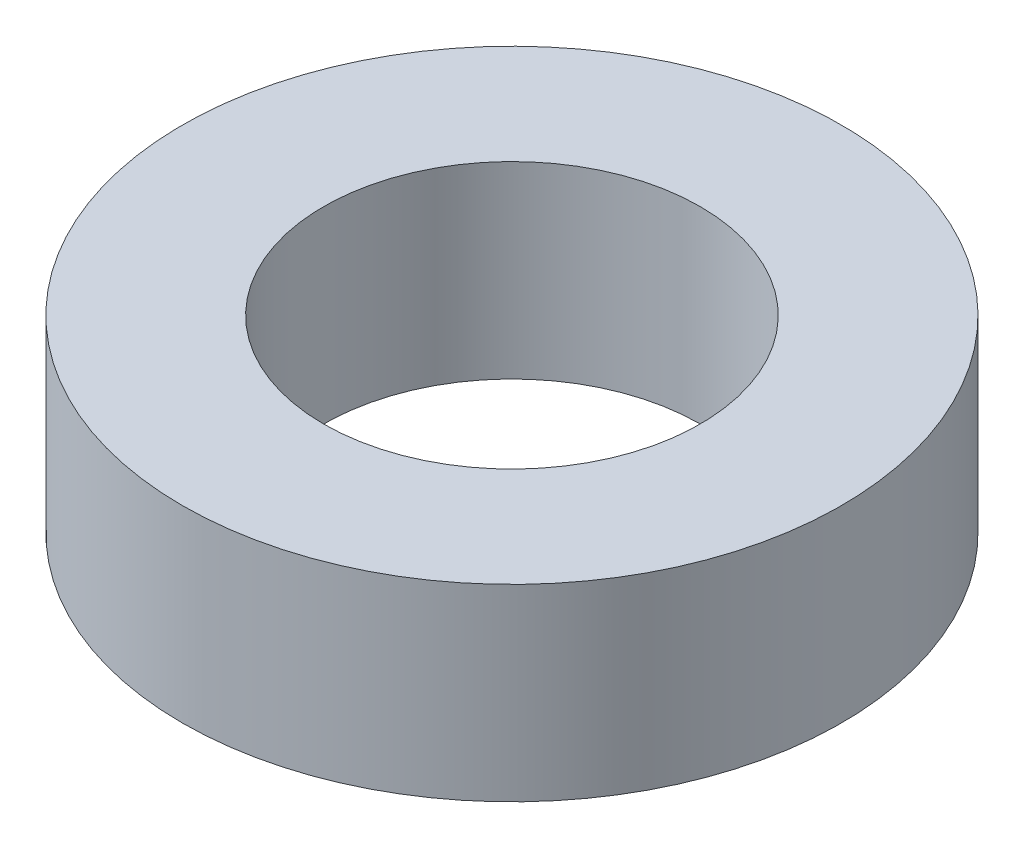
ISO-10303-21;
HEADER;
FILE_DESCRIPTION(('STEP AP214'),'2;1');
FILE_NAME('part.step','',(''),(''),'','','');
FILE_SCHEMA(('AUTOMOTIVE_DESIGN { 1 0 10303 214 1 1 1 1 }'));
ENDSEC;
DATA;
#1=APPLICATION_CONTEXT('core data for automotive mechanical design processes');
#2=APPLICATION_PROTOCOL_DEFINITION('international standard','automotive_design',2000,#1);
#3=PRODUCT_CONTEXT('',#1,'mechanical');
#4=PRODUCT('Part','Part','',(#3));
#5=PRODUCT_RELATED_PRODUCT_CATEGORY('part','',(#4));
#6=PRODUCT_DEFINITION_FORMATION('','',#4);
#7=PRODUCT_DEFINITION_CONTEXT('part definition',#1,'design');
#8=PRODUCT_DEFINITION('design','',#6,#7);
#9=PRODUCT_DEFINITION_SHAPE('','',#8);
#10=(LENGTH_UNIT() NAMED_UNIT(*) SI_UNIT(.MILLI.,.METRE.));
#11=(NAMED_UNIT(*) PLANE_ANGLE_UNIT() SI_UNIT($,.RADIAN.));
#12=(NAMED_UNIT(*) SI_UNIT($,.STERADIAN.) SOLID_ANGLE_UNIT());
#13=UNCERTAINTY_MEASURE_WITH_UNIT(LENGTH_MEASURE(1.E-05),#10,'distance_accuracy_value','');
#14=(GEOMETRIC_REPRESENTATION_CONTEXT(3) GLOBAL_UNCERTAINTY_ASSIGNED_CONTEXT((#13)) GLOBAL_UNIT_ASSIGNED_CONTEXT((#10,
#11,#12)) REPRESENTATION_CONTEXT('',''));
#15=CARTESIAN_POINT('',(0.,0.,0.));
#16=DIRECTION('',(0.,0.,1.));
#17=DIRECTION('',(1.,0.,0.));
#18=AXIS2_PLACEMENT_3D('',#15,#16,#17);
#19=CARTESIAN_POINT('',(0.,20.,0.));
#20=DIRECTION('',(0.,-1.,0.));
#21=DIRECTION('',(0.,0.,-1.));
#22=AXIS2_PLACEMENT_3D('',#19,#20,#21);
#23=CYLINDRICAL_SURFACE('',#22,35.);
#24=CARTESIAN_POINT('',(0.,20.,0.));
#25=DIRECTION('',(0.,1.,0.));
#26=DIRECTION('',(0.,0.,1.));
#27=AXIS2_PLACEMENT_3D('',#24,#25,#26);
#28=CIRCLE('',#27,35.);
#29=CARTESIAN_POINT('',(0.,20.,35.));
#30=VERTEX_POINT('',#29);
#31=EDGE_CURVE('E10',#30,#30,#28,.T.);
#32=ORIENTED_EDGE('',*,*,#31,.F.);
#33=EDGE_LOOP('',(#32));
#34=FACE_BOUND('',#33,.T.);
#35=CARTESIAN_POINT('',(0.,0.,0.));
#36=DIRECTION('',(0.,1.,0.));
#37=DIRECTION('',(0.,0.,1.));
#38=AXIS2_PLACEMENT_3D('',#35,#36,#37);
#39=CIRCLE('',#38,35.);
#40=CARTESIAN_POINT('',(0.,0.,35.));
#41=VERTEX_POINT('',#40);
#42=EDGE_CURVE('E37',#41,#41,#39,.T.);
#43=ORIENTED_EDGE('',*,*,#42,.T.);
#44=EDGE_LOOP('',(#43));
#45=FACE_BOUND('',#44,.T.);
#46=ADVANCED_FACE('F40',(#34,#45),#23,.T.);
#47=CARTESIAN_POINT('',(0.,20.,0.));
#48=DIRECTION('',(0.,1.,0.));
#49=DIRECTION('',(0.,0.,1.));
#50=AXIS2_PLACEMENT_3D('',#47,#48,#49);
#51=PLANE('',#50);
#52=CARTESIAN_POINT('',(0.,20.,0.));
#53=DIRECTION('',(0.,1.,0.));
#54=DIRECTION('',(0.,0.,1.));
#55=AXIS2_PLACEMENT_3D('',#52,#53,#54);
#56=CIRCLE('',#55,20.);
#57=CARTESIAN_POINT('',(0.,20.,20.));
#58=VERTEX_POINT('',#57);
#59=EDGE_CURVE('E50',#58,#58,#56,.T.);
#60=ORIENTED_EDGE('',*,*,#59,.F.);
#61=EDGE_LOOP('',(#60));
#62=FACE_BOUND('',#61,.T.);
#63=ORIENTED_EDGE('',*,*,#31,.T.);
#64=EDGE_LOOP('',(#63));
#65=FACE_BOUND('',#64,.T.);
#66=ADVANCED_FACE('F59',(#62,#65),#51,.T.);
#67=CARTESIAN_POINT('',(0.,0.,0.));
#68=DIRECTION('',(0.,1.,0.));
#69=DIRECTION('',(0.,0.,1.));
#70=AXIS2_PLACEMENT_3D('',#67,#68,#69);
#71=PLANE('',#70);
#72=CARTESIAN_POINT('',(0.,0.,0.));
#73=DIRECTION('',(0.,1.,0.));
#74=DIRECTION('',(0.,0.,1.));
#75=AXIS2_PLACEMENT_3D('',#72,#73,#74);
#76=CIRCLE('',#75,20.);
#77=CARTESIAN_POINT('',(0.,0.,20.));
#78=VERTEX_POINT('',#77);
#79=EDGE_CURVE('E47',#78,#78,#76,.T.);
#80=ORIENTED_EDGE('',*,*,#79,.T.);
#81=EDGE_LOOP('',(#80));
#82=FACE_BOUND('',#81,.T.);
#83=ORIENTED_EDGE('',*,*,#42,.F.);
#84=EDGE_LOOP('',(#83));
#85=FACE_BOUND('',#84,.T.);
#86=ADVANCED_FACE('F58',(#82,#85),#71,.F.);
#87=CARTESIAN_POINT('',(0.,20.,0.));
#88=DIRECTION('',(0.,-1.,0.));
#89=DIRECTION('',(0.,0.,-1.));
#90=AXIS2_PLACEMENT_3D('',#87,#88,#89);
#91=CYLINDRICAL_SURFACE('',#90,20.);
#92=ORIENTED_EDGE('',*,*,#59,.T.);
#93=EDGE_LOOP('',(#92));
#94=FACE_BOUND('',#93,.T.);
#95=ORIENTED_EDGE('',*,*,#79,.F.);
#96=EDGE_LOOP('',(#95));
#97=FACE_BOUND('',#96,.T.);
#98=ADVANCED_FACE('F54',(#94,#97),#91,.F.);
#99=CLOSED_SHELL('',(#46,#66,#86,#98));
#100=MANIFOLD_SOLID_BREP('B2',#99);
#101=ADVANCED_BREP_SHAPE_REPRESENTATION('',(#18,#100),#14);
#102=SHAPE_DEFINITION_REPRESENTATION(#9,#101);
ENDSEC;
END-ISO-10303-21;
